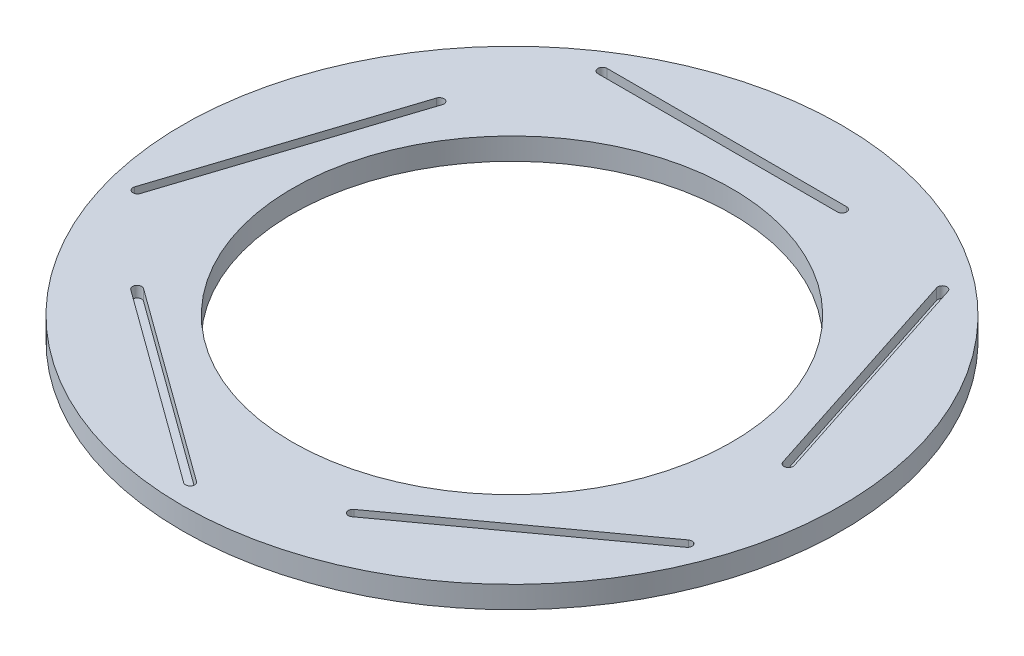
ISO-10303-21;
HEADER;
FILE_DESCRIPTION(('STEP AP214'),'2;1');
FILE_NAME('part.step','',(''),(''),'','','');
FILE_SCHEMA(('AUTOMOTIVE_DESIGN { 1 0 10303 214 1 1 1 1 }'));
ENDSEC;
DATA;
#1=APPLICATION_CONTEXT('core data for automotive mechanical design processes');
#2=APPLICATION_PROTOCOL_DEFINITION('international standard','automotive_design',2000,#1);
#3=PRODUCT_CONTEXT('',#1,'mechanical');
#4=PRODUCT('Part','Part','',(#3));
#5=PRODUCT_RELATED_PRODUCT_CATEGORY('part','',(#4));
#6=PRODUCT_DEFINITION_FORMATION('','',#4);
#7=PRODUCT_DEFINITION_CONTEXT('part definition',#1,'design');
#8=PRODUCT_DEFINITION('design','',#6,#7);
#9=PRODUCT_DEFINITION_SHAPE('','',#8);
#10=(LENGTH_UNIT() NAMED_UNIT(*) SI_UNIT(.MILLI.,.METRE.));
#11=(NAMED_UNIT(*) PLANE_ANGLE_UNIT() SI_UNIT($,.RADIAN.));
#12=(NAMED_UNIT(*) SI_UNIT($,.STERADIAN.) SOLID_ANGLE_UNIT());
#13=UNCERTAINTY_MEASURE_WITH_UNIT(LENGTH_MEASURE(1.E-05),#10,'distance_accuracy_value','');
#14=(GEOMETRIC_REPRESENTATION_CONTEXT(3) GLOBAL_UNCERTAINTY_ASSIGNED_CONTEXT((#13)) GLOBAL_UNIT_ASSIGNED_CONTEXT((#10,
#11,#12)) REPRESENTATION_CONTEXT('',''));
#15=CARTESIAN_POINT('',(0.,0.,0.));
#16=DIRECTION('',(0.,0.,1.));
#17=DIRECTION('',(1.,0.,0.));
#18=AXIS2_PLACEMENT_3D('',#15,#16,#17);
#19=CARTESIAN_POINT('',(0.,3.,0.));
#20=DIRECTION('',(0.,1.,0.));
#21=DIRECTION('',(0.,0.,1.));
#22=AXIS2_PLACEMENT_3D('',#19,#20,#21);
#23=PLANE('',#22);
#24=CARTESIAN_POINT('',(-30.2569068464412,3.,-20.3456872238756));
#25=DIRECTION('',(0.,1.,0.));
#26=DIRECTION('',(0.951056516295155,0.,0.309016994374945));
#27=AXIS2_PLACEMENT_3D('',#24,#25,#26);
#28=CIRCLE('',#27,0.624999999999997);
#29=CARTESIAN_POINT('',(-29.6624965237568,3.,-20.1525516023913));
#30=VERTEX_POINT('',#29);
#31=CARTESIAN_POINT('',(-30.8513171691257,3.,-20.5388228453599));
#32=VERTEX_POINT('',#31);
#33=EDGE_CURVE('E55',#30,#32,#28,.T.);
#34=ORIENTED_EDGE('',*,*,#33,.F.);
#35=DIRECTION('',(-0.309016994374945,0.,0.951056516295155));
#36=VECTOR('',#35,1.);
#37=CARTESIAN_POINT('',(-29.6624965237568,3.,-20.1525516023913));
#38=LINE('',#37,#36);
#39=CARTESIAN_POINT('',(-39.7716678394895,3.,10.9602785305239));
#40=VERTEX_POINT('',#39);
#41=EDGE_CURVE('E199',#30,#40,#38,.T.);
#42=ORIENTED_EDGE('',*,*,#41,.T.);
#43=CARTESIAN_POINT('',(-40.3660781621739,3.,10.7671429090395));
#44=DIRECTION('',(0.,1.,0.));
#45=DIRECTION('',(0.951056516295155,0.,0.309016994374945));
#46=AXIS2_PLACEMENT_3D('',#43,#44,#45);
#47=CIRCLE('',#46,0.624999999999994);
#48=CARTESIAN_POINT('',(-40.9604884848584,3.,10.5740072875552));
#49=VERTEX_POINT('',#48);
#50=EDGE_CURVE('E203',#49,#40,#47,.T.);
#51=ORIENTED_EDGE('',*,*,#50,.F.);
#52=DIRECTION('',(-0.309016994374945,0.,0.951056516295155));
#53=VECTOR('',#52,1.);
#54=CARTESIAN_POINT('',(-30.8513171691257,3.,-20.5388228453599));
#55=LINE('',#54,#53);
#56=EDGE_CURVE('E212',#32,#49,#55,.T.);
#57=ORIENTED_EDGE('',*,*,#56,.F.);
#58=EDGE_LOOP('',(#34,#42,#51,#57));
#59=FACE_BOUND('',#58,.T.);
#60=CARTESIAN_POINT('',(-28.6997968255399,3.,22.4888653048287));
#61=DIRECTION('',(0.,1.,0.));
#62=DIRECTION('',(0.587785252292469,0.,-0.809016994374951));
#63=AXIS2_PLACEMENT_3D('',#60,#61,#62);
#64=CIRCLE('',#63,0.624999999999997);
#65=CARTESIAN_POINT('',(-28.3324310428571,3.,21.9832296833443));
#66=VERTEX_POINT('',#65);
#67=CARTESIAN_POINT('',(-29.0671626082227,3.,22.994500926313));
#68=VERTEX_POINT('',#67);
#69=EDGE_CURVE('E63',#66,#68,#64,.T.);
#70=ORIENTED_EDGE('',*,*,#69,.F.);
#71=DIRECTION('',(0.809016994374951,0.,0.587785252292469));
#72=VECTOR('',#71,1.);
#73=CARTESIAN_POINT('',(-28.3324310428571,3.,21.9832296833443));
#74=LINE('',#73,#72);
#75=CARTESIAN_POINT('',(-1.86627694017308,3.,41.2120161916876));
#76=VERTEX_POINT('',#75);
#77=EDGE_CURVE('E233',#66,#76,#74,.T.);
#78=ORIENTED_EDGE('',*,*,#77,.T.);
#79=CARTESIAN_POINT('',(-2.23364272285587,3.,41.7176518131719));
#80=DIRECTION('',(0.,1.,0.));
#81=DIRECTION('',(0.587785252292469,0.,-0.809016994374951));
#82=AXIS2_PLACEMENT_3D('',#79,#80,#81);
#83=CIRCLE('',#82,0.624999999999994);
#84=CARTESIAN_POINT('',(-2.60100850553866,3.,42.2232874346563));
#85=VERTEX_POINT('',#84);
#86=EDGE_CURVE('E252',#85,#76,#83,.T.);
#87=ORIENTED_EDGE('',*,*,#86,.F.);
#88=DIRECTION('',(0.809016994374951,0.,0.587785252292468));
#89=VECTOR('',#88,1.);
#90=CARTESIAN_POINT('',(-29.0671626082227,3.,22.994500926313));
#91=LINE('',#90,#89);
#92=EDGE_CURVE('E247',#68,#85,#91,.T.);
#93=ORIENTED_EDGE('',*,*,#92,.F.);
#94=EDGE_LOOP('',(#70,#78,#87,#93));
#95=FACE_BOUND('',#94,.T.);
#96=CARTESIAN_POINT('',(12.5194569380414,3.,34.2445703506778));
#97=DIRECTION('',(0.,1.,0.));
#98=DIRECTION('',(-0.58778525229248,0.,-0.809016994374942));
#99=AXIS2_PLACEMENT_3D('',#96,#97,#98);
#100=CIRCLE('',#99,0.624999999999997);
#101=CARTESIAN_POINT('',(12.1520911553586,3.,33.7389347291935));
#102=VERTEX_POINT('',#101);
#103=CARTESIAN_POINT('',(12.8868227207242,3.,34.7502059721622));
#104=VERTEX_POINT('',#103);
#105=EDGE_CURVE('E286',#102,#104,#100,.T.);
#106=ORIENTED_EDGE('',*,*,#105,.F.);
#107=DIRECTION('',(0.809016994374942,0.,-0.58778525229248));
#108=VECTOR('',#107,1.);
#109=CARTESIAN_POINT('',(12.1520911553586,3.,33.7389347291935));
#110=LINE('',#109,#108);
#111=CARTESIAN_POINT('',(38.6182452580424,3.,14.5101482208498));
#112=VERTEX_POINT('',#111);
#113=EDGE_CURVE('E274',#102,#112,#110,.T.);
#114=ORIENTED_EDGE('',*,*,#113,.T.);
#115=CARTESIAN_POINT('',(38.9856110407251,3.,15.0157838423342));
#116=DIRECTION('',(0.,1.,0.));
#117=DIRECTION('',(-0.58778525229248,0.,-0.809016994374942));
#118=AXIS2_PLACEMENT_3D('',#115,#116,#117);
#119=CIRCLE('',#118,0.624999999999994);
#120=CARTESIAN_POINT('',(39.3529768234079,3.,15.5214194638185));
#121=VERTEX_POINT('',#120);
#122=EDGE_CURVE('E294',#121,#112,#119,.T.);
#123=ORIENTED_EDGE('',*,*,#122,.F.);
#124=DIRECTION('',(0.809016994374942,0.,-0.58778525229248));
#125=VECTOR('',#124,1.);
#126=CARTESIAN_POINT('',(12.8868227207242,3.,34.7502059721622));
#127=LINE('',#126,#125);
#128=EDGE_CURVE('E289',#104,#121,#127,.T.);
#129=ORIENTED_EDGE('',*,*,#128,.F.);
#130=EDGE_LOOP('',(#106,#114,#123,#129));
#131=FACE_BOUND('',#130,.T.);
#132=CARTESIAN_POINT('',(36.4372467339401,3.,-1.32455689797302));
#133=DIRECTION('',(0.,1.,0.));
#134=DIRECTION('',(-0.95105651629515,0.,0.309016994374958));
#135=AXIS2_PLACEMENT_3D('',#132,#133,#134);
#136=CIRCLE('',#135,0.624999999999997);
#137=CARTESIAN_POINT('',(35.8428364112556,3.,-1.13142127648867));
#138=VERTEX_POINT('',#137);
#139=CARTESIAN_POINT('',(37.0316570566246,3.,-1.51769251945737));
#140=VERTEX_POINT('',#139);
#141=EDGE_CURVE('E329',#138,#140,#136,.T.);
#142=ORIENTED_EDGE('',*,*,#141,.F.);
#143=DIRECTION('',(-0.309016994374958,0.,-0.95105651629515));
#144=VECTOR('',#143,1.);
#145=CARTESIAN_POINT('',(35.8428364112556,3.,-1.13142127648867));
#146=LINE('',#145,#144);
#147=CARTESIAN_POINT('',(25.7336650955225,3.,-32.2442514094037));
#148=VERTEX_POINT('',#147);
#149=EDGE_CURVE('E317',#138,#148,#146,.T.);
#150=ORIENTED_EDGE('',*,*,#149,.T.);
#151=CARTESIAN_POINT('',(26.328075418207,3.,-32.437387030888));
#152=DIRECTION('',(0.,1.,0.));
#153=DIRECTION('',(-0.95105651629515,0.,0.309016994374958));
#154=AXIS2_PLACEMENT_3D('',#151,#152,#153);
#155=CIRCLE('',#154,0.624999999999994);
#156=CARTESIAN_POINT('',(26.9224857408914,3.,-32.6305226523723));
#157=VERTEX_POINT('',#156);
#158=EDGE_CURVE('E336',#157,#148,#155,.T.);
#159=ORIENTED_EDGE('',*,*,#158,.F.);
#160=DIRECTION('',(-0.309016994374958,0.,-0.95105651629515));
#161=VECTOR('',#160,1.);
#162=CARTESIAN_POINT('',(37.0316570566246,3.,-1.51769251945737));
#163=LINE('',#162,#161);
#164=EDGE_CURVE('E332',#140,#157,#163,.T.);
#165=ORIENTED_EDGE('',*,*,#164,.F.);
#166=EDGE_LOOP('',(#142,#150,#159,#165));
#167=FACE_BOUND('',#166,.T.);
#168=CARTESIAN_POINT('',(10.,3.,-35.0631915336582));
#169=DIRECTION('',(0.,1.,0.));
#170=DIRECTION('',(0.,0.,1.));
#171=AXIS2_PLACEMENT_3D('',#168,#169,#170);
#172=CIRCLE('',#171,0.624999999999997);
#173=CARTESIAN_POINT('',(10.,3.,-34.4381915336582));
#174=VERTEX_POINT('',#173);
#175=CARTESIAN_POINT('',(10.,3.,-35.6881915336581));
#176=VERTEX_POINT('',#175);
#177=EDGE_CURVE('E222',#174,#176,#172,.T.);
#178=ORIENTED_EDGE('',*,*,#177,.F.);
#179=DIRECTION('',(-1.,0.,0.));
#180=VECTOR('',#179,1.);
#181=CARTESIAN_POINT('',(10.,3.,-34.4381915336582));
#182=LINE('',#181,#180);
#183=CARTESIAN_POINT('',(-22.7139655739023,3.,-34.4381915336582));
#184=VERTEX_POINT('',#183);
#185=EDGE_CURVE('E359',#174,#184,#182,.T.);
#186=ORIENTED_EDGE('',*,*,#185,.T.);
#187=CARTESIAN_POINT('',(-22.7139655739023,3.,-35.0631915336581));
#188=DIRECTION('',(0.,1.,0.));
#189=DIRECTION('',(0.,0.,1.));
#190=AXIS2_PLACEMENT_3D('',#187,#188,#189);
#191=CIRCLE('',#190,0.624999999999994);
#192=CARTESIAN_POINT('',(-22.7139655739023,3.,-35.6881915336581));
#193=VERTEX_POINT('',#192);
#194=EDGE_CURVE('E377',#193,#184,#191,.T.);
#195=ORIENTED_EDGE('',*,*,#194,.F.);
#196=DIRECTION('',(-1.,0.,0.));
#197=VECTOR('',#196,1.);
#198=CARTESIAN_POINT('',(10.,3.,-35.6881915336581));
#199=LINE('',#198,#197);
#200=EDGE_CURVE('E373',#176,#193,#199,.T.);
#201=ORIENTED_EDGE('',*,*,#200,.F.);
#202=EDGE_LOOP('',(#178,#186,#195,#201));
#203=FACE_BOUND('',#202,.T.);
#204=CARTESIAN_POINT('',(0.,3.,0.));
#205=DIRECTION('',(0.,1.,0.));
#206=DIRECTION('',(0.,0.,1.));
#207=AXIS2_PLACEMENT_3D('',#204,#205,#206);
#208=CIRCLE('',#207,45.);
#209=CARTESIAN_POINT('',(0.,3.,45.));
#210=VERTEX_POINT('',#209);
#211=EDGE_CURVE('E11',#210,#210,#208,.T.);
#212=ORIENTED_EDGE('',*,*,#211,.T.);
#213=EDGE_LOOP('',(#212));
#214=FACE_BOUND('',#213,.T.);
#215=CARTESIAN_POINT('',(0.,3.,0.));
#216=DIRECTION('',(0.,1.,0.));
#217=DIRECTION('',(0.,0.,1.));
#218=AXIS2_PLACEMENT_3D('',#215,#216,#217);
#219=CIRCLE('',#218,30.);
#220=CARTESIAN_POINT('',(0.,3.,30.));
#221=VERTEX_POINT('',#220);
#222=EDGE_CURVE('E397',#221,#221,#219,.T.);
#223=ORIENTED_EDGE('',*,*,#222,.F.);
#224=EDGE_LOOP('',(#223));
#225=FACE_BOUND('',#224,.T.);
#226=ADVANCED_FACE('F39',(#59,#95,#131,#167,#203,#214,#225),#23,.T.);
#227=CARTESIAN_POINT('',(0.,0.,0.));
#228=DIRECTION('',(0.,1.,0.));
#229=DIRECTION('',(0.,0.,1.));
#230=AXIS2_PLACEMENT_3D('',#227,#228,#229);
#231=PLANE('',#230);
#232=CARTESIAN_POINT('',(0.,0.,0.));
#233=DIRECTION('',(0.,1.,0.));
#234=DIRECTION('',(0.,0.,1.));
#235=AXIS2_PLACEMENT_3D('',#232,#233,#234);
#236=CIRCLE('',#235,45.);
#237=CARTESIAN_POINT('',(0.,0.,45.));
#238=VERTEX_POINT('',#237);
#239=EDGE_CURVE('E43',#238,#238,#236,.T.);
#240=ORIENTED_EDGE('',*,*,#239,.F.);
#241=EDGE_LOOP('',(#240));
#242=FACE_BOUND('',#241,.T.);
#243=CARTESIAN_POINT('',(0.,0.,0.));
#244=DIRECTION('',(0.,1.,0.));
#245=DIRECTION('',(0.,0.,1.));
#246=AXIS2_PLACEMENT_3D('',#243,#244,#245);
#247=CIRCLE('',#246,30.);
#248=CARTESIAN_POINT('',(0.,0.,30.));
#249=VERTEX_POINT('',#248);
#250=EDGE_CURVE('E387',#249,#249,#247,.T.);
#251=ORIENTED_EDGE('',*,*,#250,.T.);
#252=EDGE_LOOP('',(#251));
#253=FACE_BOUND('',#252,.T.);
#254=ADVANCED_FACE('F405',(#242,#253),#231,.F.);
#255=CARTESIAN_POINT('',(0.,3.,0.));
#256=DIRECTION('',(0.,-1.,0.));
#257=DIRECTION('',(0.,0.,-1.));
#258=AXIS2_PLACEMENT_3D('',#255,#256,#257);
#259=CYLINDRICAL_SURFACE('',#258,45.);
#260=ORIENTED_EDGE('',*,*,#211,.F.);
#261=EDGE_LOOP('',(#260));
#262=FACE_BOUND('',#261,.T.);
#263=ORIENTED_EDGE('',*,*,#239,.T.);
#264=EDGE_LOOP('',(#263));
#265=FACE_BOUND('',#264,.T.);
#266=ADVANCED_FACE('F41',(#262,#265),#259,.T.);
#267=CARTESIAN_POINT('',(0.,3.,0.));
#268=DIRECTION('',(0.,-1.,0.));
#269=DIRECTION('',(0.,0.,-1.));
#270=AXIS2_PLACEMENT_3D('',#267,#268,#269);
#271=CYLINDRICAL_SURFACE('',#270,30.);
#272=ORIENTED_EDGE('',*,*,#222,.T.);
#273=EDGE_LOOP('',(#272));
#274=FACE_BOUND('',#273,.T.);
#275=ORIENTED_EDGE('',*,*,#250,.F.);
#276=EDGE_LOOP('',(#275));
#277=FACE_BOUND('',#276,.T.);
#278=ADVANCED_FACE('F407',(#274,#277),#271,.F.);
#279=CARTESIAN_POINT('',(10.,1.5,-35.0631915336582));
#280=DIRECTION('',(0.,1.,0.));
#281=DIRECTION('',(0.,0.,1.));
#282=AXIS2_PLACEMENT_3D('',#279,#280,#281);
#283=CYLINDRICAL_SURFACE('',#282,0.624999999999997);
#284=ORIENTED_EDGE('',*,*,#177,.T.);
#285=DIRECTION('',(0.,1.,0.));
#286=VECTOR('',#285,1.);
#287=CARTESIAN_POINT('',(10.,1.5,-35.6881915336581));
#288=LINE('',#287,#286);
#289=CARTESIAN_POINT('',(10.,1.5,-35.6881915336581));
#290=VERTEX_POINT('',#289);
#291=EDGE_CURVE('E370',#290,#176,#288,.T.);
#292=ORIENTED_EDGE('',*,*,#291,.F.);
#293=CARTESIAN_POINT('',(10.,1.5,-35.0631915336582));
#294=DIRECTION('',(0.,1.,0.));
#295=DIRECTION('',(0.,0.,1.));
#296=AXIS2_PLACEMENT_3D('',#293,#294,#295);
#297=CIRCLE('',#296,0.624999999999997);
#298=CARTESIAN_POINT('',(10.,1.5,-34.4381915336582));
#299=VERTEX_POINT('',#298);
#300=EDGE_CURVE('E354',#299,#290,#297,.T.);
#301=ORIENTED_EDGE('',*,*,#300,.F.);
#302=DIRECTION('',(0.,1.,0.));
#303=VECTOR('',#302,1.);
#304=CARTESIAN_POINT('',(10.,1.5,-34.4381915336582));
#305=LINE('',#304,#303);
#306=EDGE_CURVE('E384',#299,#174,#305,.T.);
#307=ORIENTED_EDGE('',*,*,#306,.T.);
#308=EDGE_LOOP('',(#284,#292,#301,#307));
#309=FACE_BOUND('',#308,.T.);
#310=ADVANCED_FACE('F409',(#309),#283,.F.);
#311=CARTESIAN_POINT('',(10.,1.5,-34.4381915336582));
#312=DIRECTION('',(0.,0.,-1.));
#313=DIRECTION('',(-1.,0.,0.));
#314=AXIS2_PLACEMENT_3D('',#311,#312,#313);
#315=PLANE('',#314);
#316=ORIENTED_EDGE('',*,*,#185,.F.);
#317=ORIENTED_EDGE('',*,*,#306,.F.);
#318=DIRECTION('',(-1.,0.,0.));
#319=VECTOR('',#318,1.);
#320=CARTESIAN_POINT('',(10.,1.5,-34.4381915336582));
#321=LINE('',#320,#319);
#322=CARTESIAN_POINT('',(-22.7139655739023,1.5,-34.4381915336582));
#323=VERTEX_POINT('',#322);
#324=EDGE_CURVE('E367',#299,#323,#321,.T.);
#325=ORIENTED_EDGE('',*,*,#324,.T.);
#326=DIRECTION('',(0.,1.,0.));
#327=VECTOR('',#326,1.);
#328=CARTESIAN_POINT('',(-22.7139655739023,1.5,-34.4381915336582));
#329=LINE('',#328,#327);
#330=EDGE_CURVE('E388',#323,#184,#329,.T.);
#331=ORIENTED_EDGE('',*,*,#330,.T.);
#332=EDGE_LOOP('',(#316,#317,#325,#331));
#333=FACE_BOUND('',#332,.T.);
#334=ADVANCED_FACE('F416',(#333),#315,.T.);
#335=CARTESIAN_POINT('',(-22.7139655739023,1.5,-35.0631915336581));
#336=DIRECTION('',(0.,1.,0.));
#337=DIRECTION('',(0.,0.,1.));
#338=AXIS2_PLACEMENT_3D('',#335,#336,#337);
#339=CYLINDRICAL_SURFACE('',#338,0.624999999999994);
#340=ORIENTED_EDGE('',*,*,#194,.T.);
#341=ORIENTED_EDGE('',*,*,#330,.F.);
#342=CARTESIAN_POINT('',(-22.7139655739023,1.5,-35.0631915336581));
#343=DIRECTION('',(0.,1.,0.));
#344=DIRECTION('',(0.,0.,1.));
#345=AXIS2_PLACEMENT_3D('',#342,#343,#344);
#346=CIRCLE('',#345,0.624999999999994);
#347=CARTESIAN_POINT('',(-22.7139655739023,1.5,-35.6881915336581));
#348=VERTEX_POINT('',#347);
#349=EDGE_CURVE('E363',#348,#323,#346,.T.);
#350=ORIENTED_EDGE('',*,*,#349,.F.);
#351=DIRECTION('',(0.,1.,0.));
#352=VECTOR('',#351,1.);
#353=CARTESIAN_POINT('',(-22.7139655739023,1.5,-35.6881915336581));
#354=LINE('',#353,#352);
#355=EDGE_CURVE('E391',#348,#193,#354,.T.);
#356=ORIENTED_EDGE('',*,*,#355,.T.);
#357=EDGE_LOOP('',(#340,#341,#350,#356));
#358=FACE_BOUND('',#357,.T.);
#359=ADVANCED_FACE('F459',(#358),#339,.F.);
#360=CARTESIAN_POINT('',(10.,1.5,-35.6881915336581));
#361=DIRECTION('',(0.,0.,-1.));
#362=DIRECTION('',(-1.,0.,0.));
#363=AXIS2_PLACEMENT_3D('',#360,#361,#362);
#364=PLANE('',#363);
#365=ORIENTED_EDGE('',*,*,#200,.T.);
#366=ORIENTED_EDGE('',*,*,#355,.F.);
#367=DIRECTION('',(-1.,0.,0.));
#368=VECTOR('',#367,1.);
#369=CARTESIAN_POINT('',(10.,1.5,-35.6881915336581));
#370=LINE('',#369,#368);
#371=EDGE_CURVE('E358',#290,#348,#370,.T.);
#372=ORIENTED_EDGE('',*,*,#371,.F.);
#373=ORIENTED_EDGE('',*,*,#291,.T.);
#374=EDGE_LOOP('',(#365,#366,#372,#373));
#375=FACE_BOUND('',#374,.T.);
#376=ADVANCED_FACE('F451',(#375),#364,.F.);
#377=CARTESIAN_POINT('',(10.,1.5,-35.0631915336582));
#378=DIRECTION('',(0.,1.,0.));
#379=DIRECTION('',(0.,0.,1.));
#380=AXIS2_PLACEMENT_3D('',#377,#378,#379);
#381=PLANE('',#380);
#382=ORIENTED_EDGE('',*,*,#300,.T.);
#383=ORIENTED_EDGE('',*,*,#371,.T.);
#384=ORIENTED_EDGE('',*,*,#349,.T.);
#385=ORIENTED_EDGE('',*,*,#324,.F.);
#386=EDGE_LOOP('',(#382,#383,#384,#385));
#387=FACE_BOUND('',#386,.T.);
#388=ADVANCED_FACE('F455',(#387),#381,.T.);
#389=CARTESIAN_POINT('',(36.4372467339401,1.5,-1.32455689797302));
#390=DIRECTION('',(0.,1.,0.));
#391=DIRECTION('',(0.,0.,1.));
#392=AXIS2_PLACEMENT_3D('',#389,#390,#391);
#393=CYLINDRICAL_SURFACE('',#392,0.624999999999997);
#394=ORIENTED_EDGE('',*,*,#141,.T.);
#395=DIRECTION('',(0.,1.,0.));
#396=VECTOR('',#395,1.);
#397=CARTESIAN_POINT('',(37.0316570566246,1.5,-1.51769251945737));
#398=LINE('',#397,#396);
#399=CARTESIAN_POINT('',(37.0316570566246,1.5,-1.51769251945737));
#400=VERTEX_POINT('',#399);
#401=EDGE_CURVE('E328',#400,#140,#398,.T.);
#402=ORIENTED_EDGE('',*,*,#401,.F.);
#403=CARTESIAN_POINT('',(36.4372467339401,1.5,-1.32455689797302));
#404=DIRECTION('',(0.,1.,0.));
#405=DIRECTION('',(-0.95105651629515,0.,0.309016994374958));
#406=AXIS2_PLACEMENT_3D('',#403,#404,#405);
#407=CIRCLE('',#406,0.624999999999997);
#408=CARTESIAN_POINT('',(35.8428364112556,1.5,-1.13142127648867));
#409=VERTEX_POINT('',#408);
#410=EDGE_CURVE('E312',#409,#400,#407,.T.);
#411=ORIENTED_EDGE('',*,*,#410,.F.);
#412=DIRECTION('',(0.,1.,0.));
#413=VECTOR('',#412,1.);
#414=CARTESIAN_POINT('',(35.8428364112556,1.5,-1.13142127648867));
#415=LINE('',#414,#413);
#416=EDGE_CURVE('E290',#409,#138,#415,.T.);
#417=ORIENTED_EDGE('',*,*,#416,.T.);
#418=EDGE_LOOP('',(#394,#402,#411,#417));
#419=FACE_BOUND('',#418,.T.);
#420=ADVANCED_FACE('F471',(#419),#393,.F.);
#421=CARTESIAN_POINT('',(35.8428364112556,1.5,-1.13142127648867));
#422=DIRECTION('',(0.95105651629515,0.,-0.309016994374958));
#423=DIRECTION('',(-0.309016994374958,0.,-0.95105651629515));
#424=AXIS2_PLACEMENT_3D('',#421,#422,#423);
#425=PLANE('',#424);
#426=ORIENTED_EDGE('',*,*,#149,.F.);
#427=ORIENTED_EDGE('',*,*,#416,.F.);
#428=DIRECTION('',(-0.309016994374958,0.,-0.95105651629515));
#429=VECTOR('',#428,1.);
#430=CARTESIAN_POINT('',(35.8428364112556,1.5,-1.13142127648867));
#431=LINE('',#430,#429);
#432=CARTESIAN_POINT('',(25.7336650955225,1.5,-32.2442514094037));
#433=VERTEX_POINT('',#432);
#434=EDGE_CURVE('E325',#409,#433,#431,.T.);
#435=ORIENTED_EDGE('',*,*,#434,.T.);
#436=DIRECTION('',(0.,1.,0.));
#437=VECTOR('',#436,1.);
#438=CARTESIAN_POINT('',(25.7336650955225,1.5,-32.2442514094037));
#439=LINE('',#438,#437);
#440=EDGE_CURVE('E345',#433,#148,#439,.T.);
#441=ORIENTED_EDGE('',*,*,#440,.T.);
#442=EDGE_LOOP('',(#426,#427,#435,#441));
#443=FACE_BOUND('',#442,.T.);
#444=ADVANCED_FACE('F474',(#443),#425,.T.);
#445=CARTESIAN_POINT('',(26.328075418207,1.5,-32.437387030888));
#446=DIRECTION('',(0.,1.,0.));
#447=DIRECTION('',(0.,0.,1.));
#448=AXIS2_PLACEMENT_3D('',#445,#446,#447);
#449=CYLINDRICAL_SURFACE('',#448,0.624999999999994);
#450=ORIENTED_EDGE('',*,*,#158,.T.);
#451=ORIENTED_EDGE('',*,*,#440,.F.);
#452=CARTESIAN_POINT('',(26.328075418207,1.5,-32.437387030888));
#453=DIRECTION('',(0.,1.,0.));
#454=DIRECTION('',(-0.95105651629515,0.,0.309016994374958));
#455=AXIS2_PLACEMENT_3D('',#452,#453,#454);
#456=CIRCLE('',#455,0.624999999999994);
#457=CARTESIAN_POINT('',(26.9224857408914,1.5,-32.6305226523723));
#458=VERTEX_POINT('',#457);
#459=EDGE_CURVE('E321',#458,#433,#456,.T.);
#460=ORIENTED_EDGE('',*,*,#459,.F.);
#461=DIRECTION('',(0.,1.,0.));
#462=VECTOR('',#461,1.);
#463=CARTESIAN_POINT('',(26.9224857408914,1.5,-32.6305226523723));
#464=LINE('',#463,#462);
#465=EDGE_CURVE('E348',#458,#157,#464,.T.);
#466=ORIENTED_EDGE('',*,*,#465,.T.);
#467=EDGE_LOOP('',(#450,#451,#460,#466));
#468=FACE_BOUND('',#467,.T.);
#469=ADVANCED_FACE('F480',(#468),#449,.F.);
#470=CARTESIAN_POINT('',(37.0316570566246,1.5,-1.51769251945737));
#471=DIRECTION('',(0.95105651629515,0.,-0.309016994374958));
#472=DIRECTION('',(-0.309016994374958,0.,-0.95105651629515));
#473=AXIS2_PLACEMENT_3D('',#470,#471,#472);
#474=PLANE('',#473);
#475=ORIENTED_EDGE('',*,*,#164,.T.);
#476=ORIENTED_EDGE('',*,*,#465,.F.);
#477=DIRECTION('',(-0.309016994374958,0.,-0.95105651629515));
#478=VECTOR('',#477,1.);
#479=CARTESIAN_POINT('',(37.0316570566246,1.5,-1.51769251945737));
#480=LINE('',#479,#478);
#481=EDGE_CURVE('E316',#400,#458,#480,.T.);
#482=ORIENTED_EDGE('',*,*,#481,.F.);
#483=ORIENTED_EDGE('',*,*,#401,.T.);
#484=EDGE_LOOP('',(#475,#476,#482,#483));
#485=FACE_BOUND('',#484,.T.);
#486=ADVANCED_FACE('F476',(#485),#474,.F.);
#487=CARTESIAN_POINT('',(36.4372467339401,1.5,-1.32455689797302));
#488=DIRECTION('',(0.,1.,0.));
#489=DIRECTION('',(-0.95105651629515,0.,0.309016994374958));
#490=AXIS2_PLACEMENT_3D('',#487,#488,#489);
#491=PLANE('',#490);
#492=ORIENTED_EDGE('',*,*,#410,.T.);
#493=ORIENTED_EDGE('',*,*,#481,.T.);
#494=ORIENTED_EDGE('',*,*,#459,.T.);
#495=ORIENTED_EDGE('',*,*,#434,.F.);
#496=EDGE_LOOP('',(#492,#493,#494,#495));
#497=FACE_BOUND('',#496,.T.);
#498=ADVANCED_FACE('F479',(#497),#491,.T.);
#499=CARTESIAN_POINT('',(12.5194569380414,1.5,34.2445703506778));
#500=DIRECTION('',(0.,1.,0.));
#501=DIRECTION('',(0.,0.,1.));
#502=AXIS2_PLACEMENT_3D('',#499,#500,#501);
#503=CYLINDRICAL_SURFACE('',#502,0.624999999999997);
#504=ORIENTED_EDGE('',*,*,#105,.T.);
#505=DIRECTION('',(0.,1.,0.));
#506=VECTOR('',#505,1.);
#507=CARTESIAN_POINT('',(12.8868227207242,1.5,34.7502059721622));
#508=LINE('',#507,#506);
#509=CARTESIAN_POINT('',(12.8868227207242,1.5,34.7502059721622));
#510=VERTEX_POINT('',#509);
#511=EDGE_CURVE('E285',#510,#104,#508,.T.);
#512=ORIENTED_EDGE('',*,*,#511,.F.);
#513=CARTESIAN_POINT('',(12.5194569380414,1.5,34.2445703506778));
#514=DIRECTION('',(0.,1.,0.));
#515=DIRECTION('',(-0.58778525229248,0.,-0.809016994374942));
#516=AXIS2_PLACEMENT_3D('',#513,#514,#515);
#517=CIRCLE('',#516,0.624999999999997);
#518=CARTESIAN_POINT('',(12.1520911553586,1.5,33.7389347291935));
#519=VERTEX_POINT('',#518);
#520=EDGE_CURVE('E269',#519,#510,#517,.T.);
#521=ORIENTED_EDGE('',*,*,#520,.F.);
#522=DIRECTION('',(0.,1.,0.));
#523=VECTOR('',#522,1.);
#524=CARTESIAN_POINT('',(12.1520911553586,1.5,33.7389347291935));
#525=LINE('',#524,#523);
#526=EDGE_CURVE('E248',#519,#102,#525,.T.);
#527=ORIENTED_EDGE('',*,*,#526,.T.);
#528=EDGE_LOOP('',(#504,#512,#521,#527));
#529=FACE_BOUND('',#528,.T.);
#530=ADVANCED_FACE('F490',(#529),#503,.F.);
#531=CARTESIAN_POINT('',(12.1520911553586,1.5,33.7389347291935));
#532=DIRECTION('',(0.58778525229248,0.,0.809016994374942));
#533=DIRECTION('',(0.809016994374942,0.,-0.58778525229248));
#534=AXIS2_PLACEMENT_3D('',#531,#532,#533);
#535=PLANE('',#534);
#536=ORIENTED_EDGE('',*,*,#113,.F.);
#537=ORIENTED_EDGE('',*,*,#526,.F.);
#538=DIRECTION('',(0.809016994374942,0.,-0.58778525229248));
#539=VECTOR('',#538,1.);
#540=CARTESIAN_POINT('',(12.1520911553586,1.5,33.7389347291935));
#541=LINE('',#540,#539);
#542=CARTESIAN_POINT('',(38.6182452580424,1.5,14.5101482208498));
#543=VERTEX_POINT('',#542);
#544=EDGE_CURVE('E282',#519,#543,#541,.T.);
#545=ORIENTED_EDGE('',*,*,#544,.T.);
#546=DIRECTION('',(0.,1.,0.));
#547=VECTOR('',#546,1.);
#548=CARTESIAN_POINT('',(38.6182452580424,1.5,14.5101482208498));
#549=LINE('',#548,#547);
#550=EDGE_CURVE('E303',#543,#112,#549,.T.);
#551=ORIENTED_EDGE('',*,*,#550,.T.);
#552=EDGE_LOOP('',(#536,#537,#545,#551));
#553=FACE_BOUND('',#552,.T.);
#554=ADVANCED_FACE('F494',(#553),#535,.T.);
#555=CARTESIAN_POINT('',(38.9856110407251,1.5,15.0157838423342));
#556=DIRECTION('',(0.,1.,0.));
#557=DIRECTION('',(0.,0.,1.));
#558=AXIS2_PLACEMENT_3D('',#555,#556,#557);
#559=CYLINDRICAL_SURFACE('',#558,0.624999999999994);
#560=ORIENTED_EDGE('',*,*,#122,.T.);
#561=ORIENTED_EDGE('',*,*,#550,.F.);
#562=CARTESIAN_POINT('',(38.9856110407251,1.5,15.0157838423342));
#563=DIRECTION('',(0.,1.,0.));
#564=DIRECTION('',(-0.58778525229248,0.,-0.809016994374942));
#565=AXIS2_PLACEMENT_3D('',#562,#563,#564);
#566=CIRCLE('',#565,0.624999999999994);
#567=CARTESIAN_POINT('',(39.3529768234079,1.5,15.5214194638185));
#568=VERTEX_POINT('',#567);
#569=EDGE_CURVE('E278',#568,#543,#566,.T.);
#570=ORIENTED_EDGE('',*,*,#569,.F.);
#571=DIRECTION('',(0.,1.,0.));
#572=VECTOR('',#571,1.);
#573=CARTESIAN_POINT('',(39.3529768234079,1.5,15.5214194638185));
#574=LINE('',#573,#572);
#575=EDGE_CURVE('E306',#568,#121,#574,.T.);
#576=ORIENTED_EDGE('',*,*,#575,.T.);
#577=EDGE_LOOP('',(#560,#561,#570,#576));
#578=FACE_BOUND('',#577,.T.);
#579=ADVANCED_FACE('F500',(#578),#559,.F.);
#580=CARTESIAN_POINT('',(12.8868227207242,1.5,34.7502059721622));
#581=DIRECTION('',(0.58778525229248,0.,0.809016994374942));
#582=DIRECTION('',(0.809016994374942,0.,-0.58778525229248));
#583=AXIS2_PLACEMENT_3D('',#580,#581,#582);
#584=PLANE('',#583);
#585=ORIENTED_EDGE('',*,*,#128,.T.);
#586=ORIENTED_EDGE('',*,*,#575,.F.);
#587=DIRECTION('',(0.809016994374942,0.,-0.58778525229248));
#588=VECTOR('',#587,1.);
#589=CARTESIAN_POINT('',(12.8868227207242,1.5,34.7502059721622));
#590=LINE('',#589,#588);
#591=EDGE_CURVE('E273',#510,#568,#590,.T.);
#592=ORIENTED_EDGE('',*,*,#591,.F.);
#593=ORIENTED_EDGE('',*,*,#511,.T.);
#594=EDGE_LOOP('',(#585,#586,#592,#593));
#595=FACE_BOUND('',#594,.T.);
#596=ADVANCED_FACE('F496',(#595),#584,.F.);
#597=CARTESIAN_POINT('',(12.5194569380414,1.5,34.2445703506778));
#598=DIRECTION('',(0.,1.,0.));
#599=DIRECTION('',(-0.58778525229248,0.,-0.809016994374942));
#600=AXIS2_PLACEMENT_3D('',#597,#598,#599);
#601=PLANE('',#600);
#602=ORIENTED_EDGE('',*,*,#520,.T.);
#603=ORIENTED_EDGE('',*,*,#591,.T.);
#604=ORIENTED_EDGE('',*,*,#569,.T.);
#605=ORIENTED_EDGE('',*,*,#544,.F.);
#606=EDGE_LOOP('',(#602,#603,#604,#605));
#607=FACE_BOUND('',#606,.T.);
#608=ADVANCED_FACE('F499',(#607),#601,.T.);
#609=CARTESIAN_POINT('',(-28.6997968255399,1.5,22.4888653048287));
#610=DIRECTION('',(0.,1.,0.));
#611=DIRECTION('',(0.,0.,1.));
#612=AXIS2_PLACEMENT_3D('',#609,#610,#611);
#613=CYLINDRICAL_SURFACE('',#612,0.624999999999997);
#614=ORIENTED_EDGE('',*,*,#69,.T.);
#615=DIRECTION('',(0.,1.,0.));
#616=VECTOR('',#615,1.);
#617=CARTESIAN_POINT('',(-29.0671626082227,1.5,22.994500926313));
#618=LINE('',#617,#616);
#619=CARTESIAN_POINT('',(-29.0671626082227,1.5,22.994500926313));
#620=VERTEX_POINT('',#619);
#621=EDGE_CURVE('E244',#620,#68,#618,.T.);
#622=ORIENTED_EDGE('',*,*,#621,.F.);
#623=CARTESIAN_POINT('',(-28.6997968255399,1.5,22.4888653048287));
#624=DIRECTION('',(0.,1.,0.));
#625=DIRECTION('',(0.587785252292469,0.,-0.809016994374951));
#626=AXIS2_PLACEMENT_3D('',#623,#624,#625);
#627=CIRCLE('',#626,0.624999999999997);
#628=CARTESIAN_POINT('',(-28.3324310428571,1.5,21.9832296833443));
#629=VERTEX_POINT('',#628);
#630=EDGE_CURVE('E228',#629,#620,#627,.T.);
#631=ORIENTED_EDGE('',*,*,#630,.F.);
#632=DIRECTION('',(0.,1.,0.));
#633=VECTOR('',#632,1.);
#634=CARTESIAN_POINT('',(-28.3324310428571,1.5,21.9832296833443));
#635=LINE('',#634,#633);
#636=EDGE_CURVE('E213',#629,#66,#635,.T.);
#637=ORIENTED_EDGE('',*,*,#636,.T.);
#638=EDGE_LOOP('',(#614,#622,#631,#637));
#639=FACE_BOUND('',#638,.T.);
#640=ADVANCED_FACE('F510',(#639),#613,.F.);
#641=CARTESIAN_POINT('',(-28.3324310428571,1.5,21.9832296833443));
#642=DIRECTION('',(-0.587785252292468,0.,0.809016994374951));
#643=DIRECTION('',(0.809016994374951,0.,0.587785252292469));
#644=AXIS2_PLACEMENT_3D('',#641,#642,#643);
#645=PLANE('',#644);
#646=ORIENTED_EDGE('',*,*,#77,.F.);
#647=ORIENTED_EDGE('',*,*,#636,.F.);
#648=DIRECTION('',(0.809016994374951,0.,0.587785252292469));
#649=VECTOR('',#648,1.);
#650=CARTESIAN_POINT('',(-28.3324310428571,1.5,21.9832296833443));
#651=LINE('',#650,#649);
#652=CARTESIAN_POINT('',(-1.86627694017308,1.5,41.2120161916876));
#653=VERTEX_POINT('',#652);
#654=EDGE_CURVE('E241',#629,#653,#651,.T.);
#655=ORIENTED_EDGE('',*,*,#654,.T.);
#656=DIRECTION('',(0.,1.,0.));
#657=VECTOR('',#656,1.);
#658=CARTESIAN_POINT('',(-1.86627694017308,1.5,41.2120161916876));
#659=LINE('',#658,#657);
#660=EDGE_CURVE('E261',#653,#76,#659,.T.);
#661=ORIENTED_EDGE('',*,*,#660,.T.);
#662=EDGE_LOOP('',(#646,#647,#655,#661));
#663=FACE_BOUND('',#662,.T.);
#664=ADVANCED_FACE('F514',(#663),#645,.T.);
#665=CARTESIAN_POINT('',(-2.23364272285587,1.5,41.7176518131719));
#666=DIRECTION('',(0.,1.,0.));
#667=DIRECTION('',(0.,0.,1.));
#668=AXIS2_PLACEMENT_3D('',#665,#666,#667);
#669=CYLINDRICAL_SURFACE('',#668,0.624999999999994);
#670=ORIENTED_EDGE('',*,*,#86,.T.);
#671=ORIENTED_EDGE('',*,*,#660,.F.);
#672=CARTESIAN_POINT('',(-2.23364272285587,1.5,41.7176518131719));
#673=DIRECTION('',(0.,1.,0.));
#674=DIRECTION('',(0.587785252292469,0.,-0.809016994374951));
#675=AXIS2_PLACEMENT_3D('',#672,#673,#674);
#676=CIRCLE('',#675,0.624999999999994);
#677=CARTESIAN_POINT('',(-2.60100850553866,1.5,42.2232874346563));
#678=VERTEX_POINT('',#677);
#679=EDGE_CURVE('E237',#678,#653,#676,.T.);
#680=ORIENTED_EDGE('',*,*,#679,.F.);
#681=DIRECTION('',(0.,1.,0.));
#682=VECTOR('',#681,1.);
#683=CARTESIAN_POINT('',(-2.60100850553866,1.5,42.2232874346563));
#684=LINE('',#683,#682);
#685=EDGE_CURVE('E264',#678,#85,#684,.T.);
#686=ORIENTED_EDGE('',*,*,#685,.T.);
#687=EDGE_LOOP('',(#670,#671,#680,#686));
#688=FACE_BOUND('',#687,.T.);
#689=ADVANCED_FACE('F519',(#688),#669,.F.);
#690=CARTESIAN_POINT('',(-29.0671626082227,1.5,22.994500926313));
#691=DIRECTION('',(-0.587785252292468,0.,0.809016994374951));
#692=DIRECTION('',(0.809016994374951,0.,0.587785252292468));
#693=AXIS2_PLACEMENT_3D('',#690,#691,#692);
#694=PLANE('',#693);
#695=ORIENTED_EDGE('',*,*,#92,.T.);
#696=ORIENTED_EDGE('',*,*,#685,.F.);
#697=DIRECTION('',(0.809016994374951,0.,0.587785252292468));
#698=VECTOR('',#697,1.);
#699=CARTESIAN_POINT('',(-29.0671626082227,1.5,22.994500926313));
#700=LINE('',#699,#698);
#701=EDGE_CURVE('E232',#620,#678,#700,.T.);
#702=ORIENTED_EDGE('',*,*,#701,.F.);
#703=ORIENTED_EDGE('',*,*,#621,.T.);
#704=EDGE_LOOP('',(#695,#696,#702,#703));
#705=FACE_BOUND('',#704,.T.);
#706=ADVANCED_FACE('F515',(#705),#694,.F.);
#707=CARTESIAN_POINT('',(-28.6997968255399,1.5,22.4888653048287));
#708=DIRECTION('',(0.,1.,0.));
#709=DIRECTION('',(0.587785252292469,0.,-0.809016994374951));
#710=AXIS2_PLACEMENT_3D('',#707,#708,#709);
#711=PLANE('',#710);
#712=ORIENTED_EDGE('',*,*,#630,.T.);
#713=ORIENTED_EDGE('',*,*,#701,.T.);
#714=ORIENTED_EDGE('',*,*,#679,.T.);
#715=ORIENTED_EDGE('',*,*,#654,.F.);
#716=EDGE_LOOP('',(#712,#713,#714,#715));
#717=FACE_BOUND('',#716,.T.);
#718=ADVANCED_FACE('F518',(#717),#711,.T.);
#719=CARTESIAN_POINT('',(-30.2569068464412,1.5,-20.3456872238756));
#720=DIRECTION('',(0.,1.,0.));
#721=DIRECTION('',(0.,0.,1.));
#722=AXIS2_PLACEMENT_3D('',#719,#720,#721);
#723=CYLINDRICAL_SURFACE('',#722,0.624999999999997);
#724=ORIENTED_EDGE('',*,*,#33,.T.);
#725=DIRECTION('',(0.,1.,0.));
#726=VECTOR('',#725,1.);
#727=CARTESIAN_POINT('',(-30.8513171691257,1.5,-20.5388228453599));
#728=LINE('',#727,#726);
#729=CARTESIAN_POINT('',(-30.8513171691257,1.5,-20.5388228453599));
#730=VERTEX_POINT('',#729);
#731=EDGE_CURVE('E175',#730,#32,#728,.T.);
#732=ORIENTED_EDGE('',*,*,#731,.F.);
#733=CARTESIAN_POINT('',(-30.2569068464412,1.5,-20.3456872238756));
#734=DIRECTION('',(0.,1.,0.));
#735=DIRECTION('',(0.951056516295155,0.,0.309016994374945));
#736=AXIS2_PLACEMENT_3D('',#733,#734,#735);
#737=CIRCLE('',#736,0.624999999999997);
#738=CARTESIAN_POINT('',(-29.6624965237568,1.5,-20.1525516023913));
#739=VERTEX_POINT('',#738);
#740=EDGE_CURVE('E179',#739,#730,#737,.T.);
#741=ORIENTED_EDGE('',*,*,#740,.F.);
#742=DIRECTION('',(0.,1.,0.));
#743=VECTOR('',#742,1.);
#744=CARTESIAN_POINT('',(-29.6624965237568,1.5,-20.1525516023913));
#745=LINE('',#744,#743);
#746=EDGE_CURVE('E219',#739,#30,#745,.T.);
#747=ORIENTED_EDGE('',*,*,#746,.T.);
#748=EDGE_LOOP('',(#724,#732,#741,#747));
#749=FACE_BOUND('',#748,.T.);
#750=ADVANCED_FACE('F177',(#749),#723,.F.);
#751=CARTESIAN_POINT('',(-29.6624965237568,1.5,-20.1525516023913));
#752=DIRECTION('',(-0.951056516295154,0.,-0.309016994374945));
#753=DIRECTION('',(-0.309016994374945,0.,0.951056516295155));
#754=AXIS2_PLACEMENT_3D('',#751,#752,#753);
#755=PLANE('',#754);
#756=ORIENTED_EDGE('',*,*,#41,.F.);
#757=ORIENTED_EDGE('',*,*,#746,.F.);
#758=DIRECTION('',(-0.309016994374945,0.,0.951056516295155));
#759=VECTOR('',#758,1.);
#760=CARTESIAN_POINT('',(-29.6624965237568,1.5,-20.1525516023913));
#761=LINE('',#760,#759);
#762=CARTESIAN_POINT('',(-39.7716678394895,1.5,10.9602785305239));
#763=VERTEX_POINT('',#762);
#764=EDGE_CURVE('E185',#739,#763,#761,.T.);
#765=ORIENTED_EDGE('',*,*,#764,.T.);
#766=DIRECTION('',(0.,1.,0.));
#767=VECTOR('',#766,1.);
#768=CARTESIAN_POINT('',(-39.7716678394895,1.5,10.9602785305239));
#769=LINE('',#768,#767);
#770=EDGE_CURVE('E223',#763,#40,#769,.T.);
#771=ORIENTED_EDGE('',*,*,#770,.T.);
#772=EDGE_LOOP('',(#756,#757,#765,#771));
#773=FACE_BOUND('',#772,.T.);
#774=ADVANCED_FACE('F532',(#773),#755,.T.);
#775=CARTESIAN_POINT('',(-40.3660781621739,1.5,10.7671429090395));
#776=DIRECTION('',(0.,1.,0.));
#777=DIRECTION('',(0.,0.,1.));
#778=AXIS2_PLACEMENT_3D('',#775,#776,#777);
#779=CYLINDRICAL_SURFACE('',#778,0.624999999999994);
#780=ORIENTED_EDGE('',*,*,#50,.T.);
#781=ORIENTED_EDGE('',*,*,#770,.F.);
#782=CARTESIAN_POINT('',(-40.3660781621739,1.5,10.7671429090395));
#783=DIRECTION('',(0.,1.,0.));
#784=DIRECTION('',(0.951056516295155,0.,0.309016994374945));
#785=AXIS2_PLACEMENT_3D('',#782,#783,#784);
#786=CIRCLE('',#785,0.624999999999994);
#787=CARTESIAN_POINT('',(-40.9604884848584,1.5,10.5740072875552));
#788=VERTEX_POINT('',#787);
#789=EDGE_CURVE('E194',#788,#763,#786,.T.);
#790=ORIENTED_EDGE('',*,*,#789,.F.);
#791=DIRECTION('',(0.,1.,0.));
#792=VECTOR('',#791,1.);
#793=CARTESIAN_POINT('',(-40.9604884848584,1.5,10.5740072875552));
#794=LINE('',#793,#792);
#795=EDGE_CURVE('E184',#788,#49,#794,.T.);
#796=ORIENTED_EDGE('',*,*,#795,.T.);
#797=EDGE_LOOP('',(#780,#781,#790,#796));
#798=FACE_BOUND('',#797,.T.);
#799=ADVANCED_FACE('F535',(#798),#779,.F.);
#800=CARTESIAN_POINT('',(-30.8513171691257,1.5,-20.5388228453599));
#801=DIRECTION('',(-0.951056516295155,0.,-0.309016994374945));
#802=DIRECTION('',(-0.309016994374945,0.,0.951056516295155));
#803=AXIS2_PLACEMENT_3D('',#800,#801,#802);
#804=PLANE('',#803);
#805=ORIENTED_EDGE('',*,*,#56,.T.);
#806=ORIENTED_EDGE('',*,*,#795,.F.);
#807=DIRECTION('',(-0.309016994374945,0.,0.951056516295155));
#808=VECTOR('',#807,1.);
#809=CARTESIAN_POINT('',(-30.8513171691257,1.5,-20.5388228453599));
#810=LINE('',#809,#808);
#811=EDGE_CURVE('E188',#730,#788,#810,.T.);
#812=ORIENTED_EDGE('',*,*,#811,.F.);
#813=ORIENTED_EDGE('',*,*,#731,.T.);
#814=EDGE_LOOP('',(#805,#806,#812,#813));
#815=FACE_BOUND('',#814,.T.);
#816=ADVANCED_FACE('F189',(#815),#804,.F.);
#817=CARTESIAN_POINT('',(-30.2569068464412,1.5,-20.3456872238756));
#818=DIRECTION('',(0.,1.,0.));
#819=DIRECTION('',(0.951056516295155,0.,0.309016994374945));
#820=AXIS2_PLACEMENT_3D('',#817,#818,#819);
#821=PLANE('',#820);
#822=ORIENTED_EDGE('',*,*,#740,.T.);
#823=ORIENTED_EDGE('',*,*,#811,.T.);
#824=ORIENTED_EDGE('',*,*,#789,.T.);
#825=ORIENTED_EDGE('',*,*,#764,.F.);
#826=EDGE_LOOP('',(#822,#823,#824,#825));
#827=FACE_BOUND('',#826,.T.);
#828=ADVANCED_FACE('F197',(#827),#821,.T.);
#829=CLOSED_SHELL('',(#226,#254,#266,#278,#310,#334,#359,#376,#388,#420,#444,#469,#486,#498,
#530,#554,#579,#596,#608,#640,#664,#689,#706,#718,#750,#774,#799,#816,#828));
#830=MANIFOLD_SOLID_BREP('B2',#829);
#831=ADVANCED_BREP_SHAPE_REPRESENTATION('',(#18,#830),#14);
#832=SHAPE_DEFINITION_REPRESENTATION(#9,#831);
ENDSEC;
END-ISO-10303-21;
